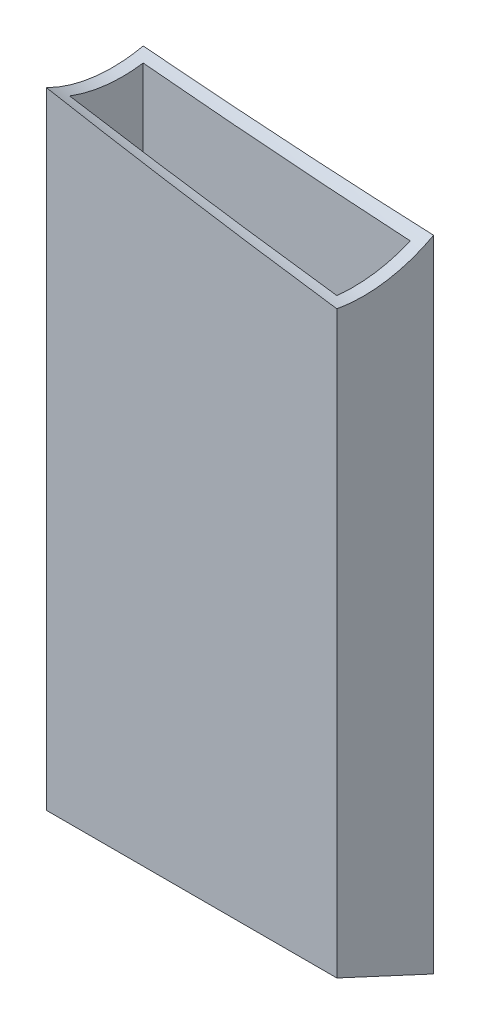
ISO-10303-21;
HEADER;
FILE_DESCRIPTION(('STEP AP214'),'2;1');
FILE_NAME('part.step','',(''),(''),'','','');
FILE_SCHEMA(('AUTOMOTIVE_DESIGN { 1 0 10303 214 1 1 1 1 }'));
ENDSEC;
DATA;
#1=APPLICATION_CONTEXT('core data for automotive mechanical design processes');
#2=APPLICATION_PROTOCOL_DEFINITION('international standard','automotive_design',2000,#1);
#3=PRODUCT_CONTEXT('',#1,'mechanical');
#4=PRODUCT('Part','Part','',(#3));
#5=PRODUCT_RELATED_PRODUCT_CATEGORY('part','',(#4));
#6=PRODUCT_DEFINITION_FORMATION('','',#4);
#7=PRODUCT_DEFINITION_CONTEXT('part definition',#1,'design');
#8=PRODUCT_DEFINITION('design','',#6,#7);
#9=PRODUCT_DEFINITION_SHAPE('','',#8);
#10=(LENGTH_UNIT() NAMED_UNIT(*) SI_UNIT(.MILLI.,.METRE.));
#11=(NAMED_UNIT(*) PLANE_ANGLE_UNIT() SI_UNIT($,.RADIAN.));
#12=(NAMED_UNIT(*) SI_UNIT($,.STERADIAN.) SOLID_ANGLE_UNIT());
#13=UNCERTAINTY_MEASURE_WITH_UNIT(LENGTH_MEASURE(1.E-05),#10,'distance_accuracy_value','');
#14=(GEOMETRIC_REPRESENTATION_CONTEXT(3) GLOBAL_UNCERTAINTY_ASSIGNED_CONTEXT((#13)) GLOBAL_UNIT_ASSIGNED_CONTEXT((#10,
#11,#12)) REPRESENTATION_CONTEXT('',''));
#15=CARTESIAN_POINT('',(0.,0.,0.));
#16=DIRECTION('',(0.,0.,1.));
#17=DIRECTION('',(1.,0.,0.));
#18=AXIS2_PLACEMENT_3D('',#15,#16,#17);
#19=CARTESIAN_POINT('',(-38.1,200.,-12.7));
#20=DIRECTION('',(1.,0.,0.));
#21=DIRECTION('',(0.,0.,-1.));
#22=AXIS2_PLACEMENT_3D('',#19,#20,#21);
#23=PLANE('',#22);
#24=CARTESIAN_POINT('',(-38.1,204.338574419077,-5.12923725627165));
#25=DIRECTION('',(1.,0.,0.));
#26=DIRECTION('',(0.,-0.645807827453337,0.763500000000001));
#27=AXIS2_PLACEMENT_3D('',#24,#25,#26);
#28=ELLIPSE('',#27,38.6877539128469,38.1);
#29=CARTESIAN_POINT('',(-38.1,166.86154722495,-12.7));
#30=VERTEX_POINT('',#29);
#31=CARTESIAN_POINT('',(-38.1,170.101029529485,12.7));
#32=VERTEX_POINT('',#31);
#33=EDGE_CURVE('E168',#30,#32,#28,.F.);
#34=ORIENTED_EDGE('',*,*,#33,.F.);
#35=DIRECTION('',(0.,-1.,0.));
#36=VECTOR('',#35,1.);
#37=CARTESIAN_POINT('',(-38.1,200.,-12.7));
#38=LINE('',#37,#36);
#39=CARTESIAN_POINT('',(-38.1,-5.89160522769169,-12.7));
#40=VERTEX_POINT('',#39);
#41=EDGE_CURVE('E124',#30,#40,#38,.T.);
#42=ORIENTED_EDGE('',*,*,#41,.T.);
#43=DIRECTION('',(0.,0.420827858242929,0.907140514874443));
#44=VECTOR('',#43,1.);
#45=CARTESIAN_POINT('',(-38.1,0.,0.));
#46=LINE('',#45,#44);
#47=CARTESIAN_POINT('',(-38.1,5.8916052276917,12.7));
#48=VERTEX_POINT('',#47);
#49=EDGE_CURVE('E161',#40,#48,#46,.T.);
#50=ORIENTED_EDGE('',*,*,#49,.T.);
#51=DIRECTION('',(0.,-1.,0.));
#52=VECTOR('',#51,1.);
#53=CARTESIAN_POINT('',(-38.1,200.,12.7));
#54=LINE('',#53,#52);
#55=EDGE_CURVE('E130',#32,#48,#54,.T.);
#56=ORIENTED_EDGE('',*,*,#55,.F.);
#57=EDGE_LOOP('',(#34,#42,#50,#56));
#58=FACE_BOUND('',#57,.T.);
#59=ADVANCED_FACE('F36',(#58),#23,.F.);
#60=CARTESIAN_POINT('',(-38.1,200.,12.7));
#61=DIRECTION('',(0.,0.,-1.));
#62=DIRECTION('',(-1.,0.,0.));
#63=AXIS2_PLACEMENT_3D('',#60,#61,#62);
#64=PLANE('',#63);
#65=CARTESIAN_POINT('',(94.3356635352268,189.257682503396,12.7));
#66=DIRECTION('',(0.,0.,-1.));
#67=DIRECTION('',(0.993578812003704,-0.113142142181011,0.));
#68=AXIS2_PLACEMENT_3D('',#65,#66,#67);
#69=ELLIPSE('',#68,287.372829610708,38.1);
#70=CARTESIAN_POINT('',(38.1,157.956406802283,12.7));
#71=VERTEX_POINT('',#70);
#72=EDGE_CURVE('E172',#32,#71,#69,.F.);
#73=ORIENTED_EDGE('',*,*,#72,.F.);
#74=ORIENTED_EDGE('',*,*,#55,.T.);
#75=DIRECTION('',(1.,0.,0.));
#76=VECTOR('',#75,1.);
#77=CARTESIAN_POINT('',(-38.1,5.89160522769169,12.7));
#78=LINE('',#77,#76);
#79=CARTESIAN_POINT('',(38.1,5.8916052276917,12.7));
#80=VERTEX_POINT('',#79);
#81=EDGE_CURVE('E119',#48,#80,#78,.T.);
#82=ORIENTED_EDGE('',*,*,#81,.T.);
#83=DIRECTION('',(0.,-1.,0.));
#84=VECTOR('',#83,1.);
#85=CARTESIAN_POINT('',(38.1,200.,12.7));
#86=LINE('',#85,#84);
#87=EDGE_CURVE('E128',#71,#80,#86,.T.);
#88=ORIENTED_EDGE('',*,*,#87,.F.);
#89=EDGE_LOOP('',(#73,#74,#82,#88));
#90=FACE_BOUND('',#89,.T.);
#91=ADVANCED_FACE('F155',(#90),#64,.F.);
#92=CARTESIAN_POINT('',(38.1,200.,-12.7));
#93=DIRECTION('',(-1.,0.,0.));
#94=DIRECTION('',(0.,0.,1.));
#95=AXIS2_PLACEMENT_3D('',#92,#93,#94);
#96=PLANE('',#95);
#97=CARTESIAN_POINT('',(38.1,195.661425580923,5.12923725627176));
#98=DIRECTION('',(-1.,0.,0.));
#99=DIRECTION('',(0.,-0.645807827453337,0.763500000000001));
#100=AXIS2_PLACEMENT_3D('',#97,#98,#99);
#101=ELLIPSE('',#100,38.6877539128469,38.1);
#102=CARTESIAN_POINT('',(38.1,161.960803613142,-12.7));
#103=VERTEX_POINT('',#102);
#104=EDGE_CURVE('E50',#71,#103,#101,.F.);
#105=ORIENTED_EDGE('',*,*,#104,.F.);
#106=ORIENTED_EDGE('',*,*,#87,.T.);
#107=DIRECTION('',(0.,0.420827858242929,0.907140514874443));
#108=VECTOR('',#107,1.);
#109=CARTESIAN_POINT('',(38.1,13.5636495416965,29.2379313484714));
#110=LINE('',#109,#108);
#111=CARTESIAN_POINT('',(38.1,-5.8916052276917,-12.7));
#112=VERTEX_POINT('',#111);
#113=EDGE_CURVE('E163',#112,#80,#110,.T.);
#114=ORIENTED_EDGE('',*,*,#113,.F.);
#115=DIRECTION('',(0.,-1.,0.));
#116=VECTOR('',#115,1.);
#117=CARTESIAN_POINT('',(38.1,200.,-12.7));
#118=LINE('',#117,#116);
#119=EDGE_CURVE('E126',#103,#112,#118,.T.);
#120=ORIENTED_EDGE('',*,*,#119,.F.);
#121=EDGE_LOOP('',(#105,#106,#114,#120));
#122=FACE_BOUND('',#121,.T.);
#123=ADVANCED_FACE('F193',(#122),#96,.F.);
#124=CARTESIAN_POINT('',(-38.1,200.,-12.7));
#125=DIRECTION('',(0.,0.,1.));
#126=DIRECTION('',(1.,0.,0.));
#127=AXIS2_PLACEMENT_3D('',#124,#125,#126);
#128=PLANE('',#127);
#129=CARTESIAN_POINT('',(-94.3356635352277,210.742317496604,-12.7));
#130=DIRECTION('',(0.,0.,1.));
#131=DIRECTION('',(0.993578812003704,-0.113142142181011,0.));
#132=AXIS2_PLACEMENT_3D('',#129,#130,#131);
#133=ELLIPSE('',#132,287.372829610708,38.1);
#134=EDGE_CURVE('E175',#103,#30,#133,.F.);
#135=ORIENTED_EDGE('',*,*,#134,.F.);
#136=ORIENTED_EDGE('',*,*,#119,.T.);
#137=DIRECTION('',(-1.,0.,0.));
#138=VECTOR('',#137,1.);
#139=CARTESIAN_POINT('',(-38.1,-5.89160522769169,-12.7));
#140=LINE('',#139,#138);
#141=EDGE_CURVE('E143',#112,#40,#140,.T.);
#142=ORIENTED_EDGE('',*,*,#141,.T.);
#143=ORIENTED_EDGE('',*,*,#41,.F.);
#144=EDGE_LOOP('',(#135,#136,#142,#143));
#145=FACE_BOUND('',#144,.T.);
#146=ADVANCED_FACE('F187',(#145),#128,.F.);
#147=CARTESIAN_POINT('',(-35.052,200.,-9.65199999999999));
#148=DIRECTION('',(1.,0.,0.));
#149=DIRECTION('',(0.,0.,-1.));
#150=AXIS2_PLACEMENT_3D('',#147,#148,#149);
#151=PLANE('',#150);
#152=DIRECTION('',(0.,-1.,0.));
#153=VECTOR('',#152,1.);
#154=CARTESIAN_POINT('',(-35.052,200.,-9.65199999999999));
#155=LINE('',#154,#153);
#156=CARTESIAN_POINT('',(-35.052,166.040888859006,-9.65199999999999));
#157=VERTEX_POINT('',#156);
#158=CARTESIAN_POINT('',(-35.052,-4.47761997304569,-9.65199999999999));
#159=VERTEX_POINT('',#158);
#160=EDGE_CURVE('E115',#157,#159,#155,.T.);
#161=ORIENTED_EDGE('',*,*,#160,.F.);
#162=CARTESIAN_POINT('',(-35.052,203.991488465551,-4.71889827576991));
#163=DIRECTION('',(1.,0.,0.));
#164=DIRECTION('',(0.,-0.645807827453337,0.763500000000001));
#165=AXIS2_PLACEMENT_3D('',#162,#163,#164);
#166=ELLIPSE('',#165,38.6877539128469,38.1);
#167=CARTESIAN_POINT('',(-35.052,168.212925121954,9.652));
#168=VERTEX_POINT('',#167);
#169=EDGE_CURVE('E58',#157,#168,#166,.F.);
#170=ORIENTED_EDGE('',*,*,#169,.T.);
#171=DIRECTION('',(0.,-1.,0.));
#172=VECTOR('',#171,1.);
#173=CARTESIAN_POINT('',(-35.052,200.,9.652));
#174=LINE('',#173,#172);
#175=CARTESIAN_POINT('',(-35.052,4.47761997304572,9.652));
#176=VERTEX_POINT('',#175);
#177=EDGE_CURVE('E117',#168,#176,#174,.T.);
#178=ORIENTED_EDGE('',*,*,#177,.T.);
#179=DIRECTION('',(0.,0.420827858242929,0.907140514874443));
#180=VECTOR('',#179,1.);
#181=CARTESIAN_POINT('',(-35.052,31.7345662546662,68.4073314247102));
#182=LINE('',#181,#180);
#183=EDGE_CURVE('E137',#159,#176,#182,.T.);
#184=ORIENTED_EDGE('',*,*,#183,.F.);
#185=EDGE_LOOP('',(#161,#170,#178,#184));
#186=FACE_BOUND('',#185,.T.);
#187=ADVANCED_FACE('F141',(#186),#151,.T.);
#188=CARTESIAN_POINT('',(-35.052,200.,9.652));
#189=DIRECTION('',(0.,0.,-1.));
#190=DIRECTION('',(-1.,0.,0.));
#191=AXIS2_PLACEMENT_3D('',#188,#189,#190);
#192=PLANE('',#191);
#193=ORIENTED_EDGE('',*,*,#177,.F.);
#194=CARTESIAN_POINT('',(71.6951042867722,191.835838702581,9.65199999999998));
#195=DIRECTION('',(0.,0.,-1.));
#196=DIRECTION('',(0.993578812003704,-0.113142142181011,0.));
#197=AXIS2_PLACEMENT_3D('',#194,#195,#196);
#198=ELLIPSE('',#197,287.372829610708,38.1);
#199=CARTESIAN_POINT('',(35.052,157.909352830659,9.65199999999999));
#200=VERTEX_POINT('',#199);
#201=EDGE_CURVE('E110',#168,#200,#198,.F.);
#202=ORIENTED_EDGE('',*,*,#201,.T.);
#203=DIRECTION('',(0.,-1.,0.));
#204=VECTOR('',#203,1.);
#205=CARTESIAN_POINT('',(35.052,200.,9.65199999999999));
#206=LINE('',#205,#204);
#207=CARTESIAN_POINT('',(35.052,4.47761997304566,9.65199999999999));
#208=VERTEX_POINT('',#207);
#209=EDGE_CURVE('E109',#200,#208,#206,.T.);
#210=ORIENTED_EDGE('',*,*,#209,.T.);
#211=DIRECTION('',(1.,0.,0.));
#212=VECTOR('',#211,1.);
#213=CARTESIAN_POINT('',(-35.052,4.47761997304572,9.652));
#214=LINE('',#213,#212);
#215=EDGE_CURVE('E144',#176,#208,#214,.T.);
#216=ORIENTED_EDGE('',*,*,#215,.F.);
#217=EDGE_LOOP('',(#193,#202,#210,#216));
#218=FACE_BOUND('',#217,.T.);
#219=ADVANCED_FACE('F179',(#218),#192,.T.);
#220=CARTESIAN_POINT('',(35.052,200.,-9.652));
#221=DIRECTION('',(-1.,0.,0.));
#222=DIRECTION('',(0.,0.,1.));
#223=AXIS2_PLACEMENT_3D('',#220,#221,#222);
#224=PLANE('',#223);
#225=ORIENTED_EDGE('',*,*,#209,.F.);
#226=CARTESIAN_POINT('',(35.052,196.008511534449,4.71889827577003));
#227=DIRECTION('',(-1.,0.,0.));
#228=DIRECTION('',(0.,-0.645807827453337,0.763500000000001));
#229=AXIS2_PLACEMENT_3D('',#226,#227,#228);
#230=ELLIPSE('',#229,38.6877539128469,38.1);
#231=CARTESIAN_POINT('',(35.052,160.662724118413,-9.652));
#232=VERTEX_POINT('',#231);
#233=EDGE_CURVE('E98',#200,#232,#230,.F.);
#234=ORIENTED_EDGE('',*,*,#233,.T.);
#235=DIRECTION('',(0.,-1.,0.));
#236=VECTOR('',#235,1.);
#237=CARTESIAN_POINT('',(35.052,200.,-9.652));
#238=LINE('',#237,#236);
#239=CARTESIAN_POINT('',(35.052,-4.47761997304569,-9.652));
#240=VERTEX_POINT('',#239);
#241=EDGE_CURVE('E107',#232,#240,#238,.T.);
#242=ORIENTED_EDGE('',*,*,#241,.T.);
#243=DIRECTION('',(0.,-0.420827858242929,-0.907140514874443));
#244=VECTOR('',#243,1.);
#245=CARTESIAN_POINT('',(35.052,31.7345662546662,68.4073314247102));
#246=LINE('',#245,#244);
#247=EDGE_CURVE('E139',#208,#240,#246,.T.);
#248=ORIENTED_EDGE('',*,*,#247,.F.);
#249=EDGE_LOOP('',(#225,#234,#242,#248));
#250=FACE_BOUND('',#249,.T.);
#251=ADVANCED_FACE('F105',(#250),#224,.T.);
#252=CARTESIAN_POINT('',(-35.052,200.,-9.65199999999999));
#253=DIRECTION('',(0.,0.,1.));
#254=DIRECTION('',(1.,0.,0.));
#255=AXIS2_PLACEMENT_3D('',#252,#253,#254);
#256=PLANE('',#255);
#257=ORIENTED_EDGE('',*,*,#241,.F.);
#258=CARTESIAN_POINT('',(-71.695104286773,208.164161297419,-9.65199999999998));
#259=DIRECTION('',(0.,0.,1.));
#260=DIRECTION('',(0.993578812003704,-0.113142142181011,0.));
#261=AXIS2_PLACEMENT_3D('',#258,#259,#260);
#262=ELLIPSE('',#261,287.372829610708,38.1);
#263=EDGE_CURVE('E11',#232,#157,#262,.F.);
#264=ORIENTED_EDGE('',*,*,#263,.T.);
#265=ORIENTED_EDGE('',*,*,#160,.T.);
#266=DIRECTION('',(-1.,0.,0.));
#267=VECTOR('',#266,1.);
#268=CARTESIAN_POINT('',(-35.052,-4.47761997304569,-9.65199999999999));
#269=LINE('',#268,#267);
#270=EDGE_CURVE('E43',#240,#159,#269,.T.);
#271=ORIENTED_EDGE('',*,*,#270,.F.);
#272=EDGE_LOOP('',(#257,#264,#265,#271));
#273=FACE_BOUND('',#272,.T.);
#274=ADVANCED_FACE('F113',(#273),#256,.T.);
#275=CARTESIAN_POINT('',(-38.1,13.5636495416965,29.2379313484714));
#276=DIRECTION('',(0.,0.907140514874443,-0.420827858242929));
#277=DIRECTION('',(0.,0.420827858242929,0.907140514874443));
#278=AXIS2_PLACEMENT_3D('',#275,#276,#277);
#279=PLANE('',#278);
#280=ORIENTED_EDGE('',*,*,#183,.T.);
#281=ORIENTED_EDGE('',*,*,#215,.T.);
#282=ORIENTED_EDGE('',*,*,#247,.T.);
#283=ORIENTED_EDGE('',*,*,#270,.T.);
#284=EDGE_LOOP('',(#280,#281,#282,#283));
#285=FACE_BOUND('',#284,.T.);
#286=ORIENTED_EDGE('',*,*,#49,.F.);
#287=ORIENTED_EDGE('',*,*,#141,.F.);
#288=ORIENTED_EDGE('',*,*,#113,.T.);
#289=ORIENTED_EDGE('',*,*,#81,.F.);
#290=EDGE_LOOP('',(#286,#287,#288,#289));
#291=FACE_BOUND('',#290,.T.);
#292=ADVANCED_FACE('F134',(#285,#291),#279,.F.);
#293=CARTESIAN_POINT('',(-192.340643032273,221.902472273194,-25.8939840455746));
#294=DIRECTION('',(0.984807753012209,-0.112143352360309,0.132580383648699));
#295=DIRECTION('',(0.133422004439213,0.,-0.991059316454582));
#296=AXIS2_PLACEMENT_3D('',#293,#294,#295);
#297=CYLINDRICAL_SURFACE('',#296,38.1);
#298=ORIENTED_EDGE('',*,*,#263,.F.);
#299=ORIENTED_EDGE('',*,*,#233,.F.);
#300=ORIENTED_EDGE('',*,*,#201,.F.);
#301=ORIENTED_EDGE('',*,*,#169,.F.);
#302=EDGE_LOOP('',(#298,#299,#300,#301));
#303=FACE_BOUND('',#302,.T.);
#304=ORIENTED_EDGE('',*,*,#33,.T.);
#305=ORIENTED_EDGE('',*,*,#72,.T.);
#306=ORIENTED_EDGE('',*,*,#104,.T.);
#307=ORIENTED_EDGE('',*,*,#134,.T.);
#308=EDGE_LOOP('',(#304,#305,#306,#307));
#309=FACE_BOUND('',#308,.T.);
#310=ADVANCED_FACE('F97',(#303,#309),#297,.F.);
#311=CLOSED_SHELL('',(#59,#91,#123,#146,#187,#219,#251,#274,#292,#310));
#312=MANIFOLD_SOLID_BREP('B2',#311);
#313=ADVANCED_BREP_SHAPE_REPRESENTATION('',(#18,#312),#14);
#314=SHAPE_DEFINITION_REPRESENTATION(#9,#313);
ENDSEC;
END-ISO-10303-21;
